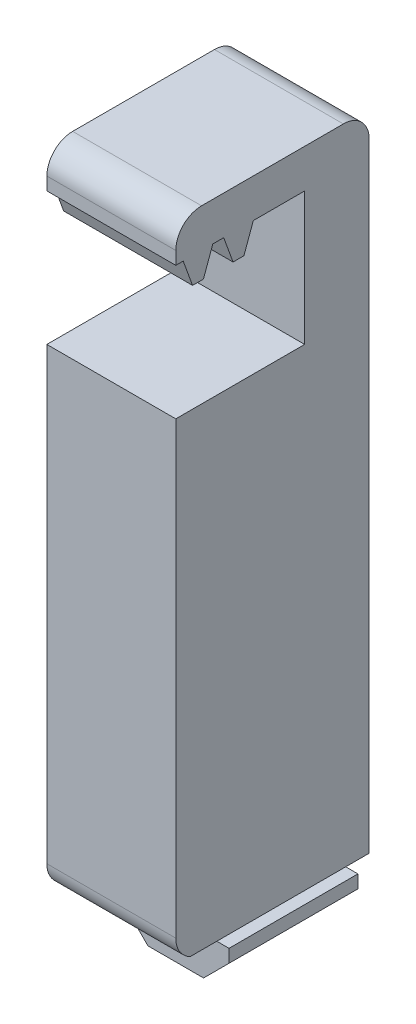
ISO-10303-21;
HEADER;
FILE_DESCRIPTION(('STEP AP214'),'2;1');
FILE_NAME('part.step','',(''),(''),'','','');
FILE_SCHEMA(('AUTOMOTIVE_DESIGN { 1 0 10303 214 1 1 1 1 }'));
ENDSEC;
DATA;
#1=APPLICATION_CONTEXT('core data for automotive mechanical design processes');
#2=APPLICATION_PROTOCOL_DEFINITION('international standard','automotive_design',2000,#1);
#3=PRODUCT_CONTEXT('',#1,'mechanical');
#4=PRODUCT('Part','Part','',(#3));
#5=PRODUCT_RELATED_PRODUCT_CATEGORY('part','',(#4));
#6=PRODUCT_DEFINITION_FORMATION('','',#4);
#7=PRODUCT_DEFINITION_CONTEXT('part definition',#1,'design');
#8=PRODUCT_DEFINITION('design','',#6,#7);
#9=PRODUCT_DEFINITION_SHAPE('','',#8);
#10=(LENGTH_UNIT() NAMED_UNIT(*) SI_UNIT(.MILLI.,.METRE.));
#11=(NAMED_UNIT(*) PLANE_ANGLE_UNIT() SI_UNIT($,.RADIAN.));
#12=(NAMED_UNIT(*) SI_UNIT($,.STERADIAN.) SOLID_ANGLE_UNIT());
#13=UNCERTAINTY_MEASURE_WITH_UNIT(LENGTH_MEASURE(1.E-05),#10,'distance_accuracy_value','');
#14=(GEOMETRIC_REPRESENTATION_CONTEXT(3) GLOBAL_UNCERTAINTY_ASSIGNED_CONTEXT((#13)) GLOBAL_UNIT_ASSIGNED_CONTEXT((#10,
#11,#12)) REPRESENTATION_CONTEXT('',''));
#15=CARTESIAN_POINT('',(0.,0.,0.));
#16=DIRECTION('',(0.,0.,1.));
#17=DIRECTION('',(1.,0.,0.));
#18=AXIS2_PLACEMENT_3D('',#15,#16,#17);
#19=CARTESIAN_POINT('',(6.35,63.7545080000001,0.));
#20=DIRECTION('',(0.,0.,-1.));
#21=DIRECTION('',(0.,1.,0.));
#22=AXIS2_PLACEMENT_3D('',#19,#20,#21);
#23=PLANE('',#22);
#24=DIRECTION('',(0.,-1.,0.));
#25=VECTOR('',#24,1.);
#26=CARTESIAN_POINT('',(6.35,63.7545080000001,0.));
#27=LINE('',#26,#25);
#28=CARTESIAN_POINT('',(6.35,61.2145080000001,0.));
#29=VERTEX_POINT('',#28);
#30=CARTESIAN_POINT('',(6.35,59.9445080000007,0.));
#31=VERTEX_POINT('',#30);
#32=EDGE_CURVE('E436',#29,#31,#27,.T.);
#33=ORIENTED_EDGE('',*,*,#32,.F.);
#34=DIRECTION('',(-1.,0.,0.));
#35=VECTOR('',#34,1.);
#36=CARTESIAN_POINT('',(6.35,61.2145080000001,0.));
#37=LINE('',#36,#35);
#38=CARTESIAN_POINT('',(-6.35,61.2145080000001,0.));
#39=VERTEX_POINT('',#38);
#40=EDGE_CURVE('E490',#29,#39,#37,.T.);
#41=ORIENTED_EDGE('',*,*,#40,.T.);
#42=DIRECTION('',(0.,-1.,0.));
#43=VECTOR('',#42,1.);
#44=CARTESIAN_POINT('',(-6.35,63.7545080000001,0.));
#45=LINE('',#44,#43);
#46=CARTESIAN_POINT('',(-6.35,59.9445080000007,0.));
#47=VERTEX_POINT('',#46);
#48=EDGE_CURVE('E435',#39,#47,#45,.T.);
#49=ORIENTED_EDGE('',*,*,#48,.T.);
#50=DIRECTION('',(1.,0.,0.));
#51=VECTOR('',#50,1.);
#52=CARTESIAN_POINT('',(-6.35,59.9445080000007,0.));
#53=LINE('',#52,#51);
#54=EDGE_CURVE('E414',#47,#31,#53,.T.);
#55=ORIENTED_EDGE('',*,*,#54,.T.);
#56=EDGE_LOOP('',(#33,#41,#49,#55));
#57=FACE_BOUND('',#56,.T.);
#58=ADVANCED_FACE('F35',(#57),#23,.F.);
#59=CARTESIAN_POINT('',(6.35,57.4045080000001,0.));
#60=DIRECTION('',(0.,1.,0.));
#61=DIRECTION('',(0.,0.,1.));
#62=AXIS2_PLACEMENT_3D('',#59,#60,#61);
#63=PLANE('',#62);
#64=DIRECTION('',(0.,0.,-1.));
#65=VECTOR('',#64,1.);
#66=CARTESIAN_POINT('',(6.35,57.4045080000001,0.));
#67=LINE('',#66,#65);
#68=CARTESIAN_POINT('',(6.35,57.4045080000001,-1.65498839503609));
#69=VERTEX_POINT('',#68);
#70=CARTESIAN_POINT('',(6.35,57.4045080000001,-2.72541999999958));
#71=VERTEX_POINT('',#70);
#72=EDGE_CURVE('E442',#69,#71,#67,.T.);
#73=ORIENTED_EDGE('',*,*,#72,.F.);
#74=DIRECTION('',(-1.,0.,0.));
#75=VECTOR('',#74,1.);
#76=CARTESIAN_POINT('',(6.35,57.4045080000001,-1.65498839503609));
#77=LINE('',#76,#75);
#78=CARTESIAN_POINT('',(-6.35,57.4045080000001,-1.65498839503609));
#79=VERTEX_POINT('',#78);
#80=EDGE_CURVE('E429',#69,#79,#77,.T.);
#81=ORIENTED_EDGE('',*,*,#80,.T.);
#82=DIRECTION('',(0.,0.,-1.));
#83=VECTOR('',#82,1.);
#84=CARTESIAN_POINT('',(-6.35,57.4045080000001,0.));
#85=LINE('',#84,#83);
#86=CARTESIAN_POINT('',(-6.35,57.4045080000001,-2.72541999999958));
#87=VERTEX_POINT('',#86);
#88=EDGE_CURVE('E260',#79,#87,#85,.T.);
#89=ORIENTED_EDGE('',*,*,#88,.T.);
#90=DIRECTION('',(1.,0.,0.));
#91=VECTOR('',#90,1.);
#92=CARTESIAN_POINT('',(6.35,57.4045080000001,-2.72541999999958));
#93=LINE('',#92,#91);
#94=EDGE_CURVE('E426',#87,#71,#93,.T.);
#95=ORIENTED_EDGE('',*,*,#94,.T.);
#96=EDGE_LOOP('',(#73,#81,#89,#95));
#97=FACE_BOUND('',#96,.T.);
#98=ADVANCED_FACE('F587',(#97),#63,.F.);
#99=CARTESIAN_POINT('',(6.35,0.,0.));
#100=DIRECTION('',(1.,0.,0.));
#101=DIRECTION('',(0.,0.,-1.));
#102=AXIS2_PLACEMENT_3D('',#99,#100,#101);
#103=PLANE('',#102);
#104=DIRECTION('',(0.,-1.,0.));
#105=VECTOR('',#104,1.);
#106=CARTESIAN_POINT('',(6.35,57.4045080000001,-12.7));
#107=LINE('',#106,#105);
#108=CARTESIAN_POINT('',(6.35,59.9445080000001,-12.7));
#109=VERTEX_POINT('',#108);
#110=CARTESIAN_POINT('',(6.35,46.8476330000001,-12.7));
#111=VERTEX_POINT('',#110);
#112=EDGE_CURVE('E443',#109,#111,#107,.T.);
#113=ORIENTED_EDGE('',*,*,#112,.T.);
#114=DIRECTION('',(0.,0.,-1.));
#115=VECTOR('',#114,1.);
#116=CARTESIAN_POINT('',(6.35,46.8476330000001,0.));
#117=LINE('',#116,#115);
#118=CARTESIAN_POINT('',(6.35,46.8476330000001,0.));
#119=VERTEX_POINT('',#118);
#120=EDGE_CURVE('E264',#119,#111,#117,.T.);
#121=ORIENTED_EDGE('',*,*,#120,.F.);
#122=DIRECTION('',(0.,-1.,0.));
#123=VECTOR('',#122,1.);
#124=CARTESIAN_POINT('',(6.35,47.2445080000001,0.));
#125=LINE('',#124,#123);
#126=CARTESIAN_POINT('',(6.35,2.54,0.));
#127=VERTEX_POINT('',#126);
#128=EDGE_CURVE('E445',#119,#127,#125,.T.);
#129=ORIENTED_EDGE('',*,*,#128,.T.);
#130=CARTESIAN_POINT('',(6.35,2.54,-2.54));
#131=DIRECTION('',(1.,0.,0.));
#132=DIRECTION('',(0.,0.,-1.));
#133=AXIS2_PLACEMENT_3D('',#130,#131,#132);
#134=CIRCLE('',#133,2.54);
#135=CARTESIAN_POINT('',(6.35,0.253999999999999,-1.43283966834067));
#136=VERTEX_POINT('',#135);
#137=EDGE_CURVE('E487',#127,#136,#134,.T.);
#138=ORIENTED_EDGE('',*,*,#137,.T.);
#139=DIRECTION('',(0.,0.,-1.));
#140=VECTOR('',#139,1.);
#141=CARTESIAN_POINT('',(6.35,0.253999999999999,0.));
#142=LINE('',#141,#140);
#143=CARTESIAN_POINT('',(6.35,0.254000000000001,-19.05));
#144=VERTEX_POINT('',#143);
#145=EDGE_CURVE('E312',#136,#144,#142,.T.);
#146=ORIENTED_EDGE('',*,*,#145,.T.);
#147=DIRECTION('',(0.,1.,0.));
#148=VECTOR('',#147,1.);
#149=CARTESIAN_POINT('',(6.35,63.7545080000001,-19.05));
#150=LINE('',#149,#148);
#151=CARTESIAN_POINT('',(6.35,61.2145080000001,-19.05));
#152=VERTEX_POINT('',#151);
#153=EDGE_CURVE('E447',#144,#152,#150,.T.);
#154=ORIENTED_EDGE('',*,*,#153,.T.);
#155=CARTESIAN_POINT('',(6.35,61.2145080000001,-16.51));
#156=DIRECTION('',(1.,0.,0.));
#157=DIRECTION('',(0.,0.,-1.));
#158=AXIS2_PLACEMENT_3D('',#155,#156,#157);
#159=CIRCLE('',#158,2.54);
#160=CARTESIAN_POINT('',(6.35,63.7545080000001,-16.51));
#161=VERTEX_POINT('',#160);
#162=EDGE_CURVE('E483',#152,#161,#159,.T.);
#163=ORIENTED_EDGE('',*,*,#162,.T.);
#164=DIRECTION('',(0.,0.,1.));
#165=VECTOR('',#164,1.);
#166=CARTESIAN_POINT('',(6.35,63.7545080000001,-12.7));
#167=LINE('',#166,#165);
#168=CARTESIAN_POINT('',(6.35,63.7545080000001,-2.54));
#169=VERTEX_POINT('',#168);
#170=EDGE_CURVE('E449',#161,#169,#167,.T.);
#171=ORIENTED_EDGE('',*,*,#170,.T.);
#172=CARTESIAN_POINT('',(6.35,61.2145080000001,-2.54));
#173=DIRECTION('',(1.,0.,0.));
#174=DIRECTION('',(0.,0.,-1.));
#175=AXIS2_PLACEMENT_3D('',#172,#173,#174);
#176=CIRCLE('',#175,2.54);
#177=EDGE_CURVE('E485',#169,#29,#176,.T.);
#178=ORIENTED_EDGE('',*,*,#177,.T.);
#179=ORIENTED_EDGE('',*,*,#32,.T.);
#180=DIRECTION('',(0.,0.,-1.));
#181=VECTOR('',#180,1.);
#182=CARTESIAN_POINT('',(6.35,59.9445080000007,0.));
#183=LINE('',#182,#181);
#184=CARTESIAN_POINT('',(6.35,59.9445080000007,-0.730503999999521));
#185=VERTEX_POINT('',#184);
#186=EDGE_CURVE('E403',#31,#185,#183,.T.);
#187=ORIENTED_EDGE('',*,*,#186,.T.);
#188=DIRECTION('',(0.,0.939692620785888,0.342020143325726));
#189=VECTOR('',#188,1.);
#190=CARTESIAN_POINT('',(6.35,7.24695483556498,-19.9108447705185));
#191=LINE('',#190,#189);
#192=EDGE_CURVE('E401',#69,#185,#191,.T.);
#193=ORIENTED_EDGE('',*,*,#192,.F.);
#194=ORIENTED_EDGE('',*,*,#72,.T.);
#195=DIRECTION('',(0.,-0.939692620785888,0.342020143325726));
#196=VECTOR('',#195,1.);
#197=CARTESIAN_POINT('',(6.35,5.83911871471688,16.0428468181965));
#198=LINE('',#197,#196);
#199=CARTESIAN_POINT('',(6.35,59.9445080000007,-3.6499043950361));
#200=VERTEX_POINT('',#199);
#201=EDGE_CURVE('E399',#200,#71,#198,.T.);
#202=ORIENTED_EDGE('',*,*,#201,.F.);
#203=DIRECTION('',(0.,0.,-1.));
#204=VECTOR('',#203,1.);
#205=CARTESIAN_POINT('',(6.35,59.9445080000007,0.));
#206=LINE('',#205,#204);
#207=CARTESIAN_POINT('',(6.35,59.9445080000007,-4.72033599999955));
#208=VERTEX_POINT('',#207);
#209=EDGE_CURVE('E396',#200,#208,#206,.T.);
#210=ORIENTED_EDGE('',*,*,#209,.T.);
#211=DIRECTION('',(0.,0.939692620785888,0.342020143325726));
#212=VECTOR('',#211,1.);
#213=CARTESIAN_POINT('',(6.35,8.5292621227306,-23.4339550868075));
#214=LINE('',#213,#212);
#215=CARTESIAN_POINT('',(6.35,57.4045080000001,-5.64482039503605));
#216=VERTEX_POINT('',#215);
#217=EDGE_CURVE('E378',#216,#208,#214,.T.);
#218=ORIENTED_EDGE('',*,*,#217,.F.);
#219=CARTESIAN_POINT('',(6.35,57.4045080000001,-6.71525199999965));
#220=VERTEX_POINT('',#219);
#221=EDGE_CURVE('E438',#216,#220,#67,.T.);
#222=ORIENTED_EDGE('',*,*,#221,.T.);
#223=DIRECTION('',(0.,-0.939692620785888,0.342020143325726));
#224=VECTOR('',#223,1.);
#225=CARTESIAN_POINT('',(6.35,4.55681142755125,12.5197365019074));
#226=LINE('',#225,#224);
#227=CARTESIAN_POINT('',(6.35,59.9445080000007,-7.63973639503612));
#228=VERTEX_POINT('',#227);
#229=EDGE_CURVE('E383',#228,#220,#226,.T.);
#230=ORIENTED_EDGE('',*,*,#229,.F.);
#231=DIRECTION('',(0.,-1.35653261717461E-13,-1.));
#232=VECTOR('',#231,1.);
#233=CARTESIAN_POINT('',(6.35,59.9445080000018,-8.10462807976364E-12));
#234=LINE('',#233,#232);
#235=EDGE_CURVE('E406',#228,#109,#234,.T.);
#236=ORIENTED_EDGE('',*,*,#235,.T.);
#237=EDGE_LOOP('',(#113,#121,#129,#138,#146,#154,#163,#171,#178,#179,#187,#193,#194,#202,#210,
#218,#222,#230,#236));
#238=FACE_BOUND('',#237,.T.);
#239=ADVANCED_FACE('F537',(#238),#103,.T.);
#240=CARTESIAN_POINT('',(-6.35,0.,0.));
#241=DIRECTION('',(1.,0.,0.));
#242=DIRECTION('',(0.,0.,-1.));
#243=AXIS2_PLACEMENT_3D('',#240,#241,#242);
#244=PLANE('',#243);
#245=DIRECTION('',(0.,0.,-1.));
#246=VECTOR('',#245,1.);
#247=CARTESIAN_POINT('',(-6.35,46.8476330000001,0.));
#248=LINE('',#247,#246);
#249=CARTESIAN_POINT('',(-6.35,46.8476330000001,0.));
#250=VERTEX_POINT('',#249);
#251=CARTESIAN_POINT('',(-6.35,46.8476330000001,-12.7));
#252=VERTEX_POINT('',#251);
#253=EDGE_CURVE('E50',#250,#252,#248,.T.);
#254=ORIENTED_EDGE('',*,*,#253,.T.);
#255=DIRECTION('',(0.,-1.,0.));
#256=VECTOR('',#255,1.);
#257=CARTESIAN_POINT('',(-6.35,57.4045080000001,-12.7));
#258=LINE('',#257,#256);
#259=CARTESIAN_POINT('',(-6.35,59.9445080000001,-12.7));
#260=VERTEX_POINT('',#259);
#261=EDGE_CURVE('E250',#260,#252,#258,.T.);
#262=ORIENTED_EDGE('',*,*,#261,.F.);
#263=DIRECTION('',(0.,-1.35653261717461E-13,-1.));
#264=VECTOR('',#263,1.);
#265=CARTESIAN_POINT('',(-6.35,59.9445080000018,-8.10462807976364E-12));
#266=LINE('',#265,#264);
#267=CARTESIAN_POINT('',(-6.35,59.9445080000007,-7.63973639503612));
#268=VERTEX_POINT('',#267);
#269=EDGE_CURVE('E389',#268,#260,#266,.T.);
#270=ORIENTED_EDGE('',*,*,#269,.F.);
#271=DIRECTION('',(0.,-0.939692620785888,0.342020143325726));
#272=VECTOR('',#271,1.);
#273=CARTESIAN_POINT('',(-6.35,4.55681142755125,12.5197365019074));
#274=LINE('',#273,#272);
#275=CARTESIAN_POINT('',(-6.35,57.4045080000001,-6.71525199999965));
#276=VERTEX_POINT('',#275);
#277=EDGE_CURVE('E391',#268,#276,#274,.T.);
#278=ORIENTED_EDGE('',*,*,#277,.T.);
#279=CARTESIAN_POINT('',(-6.35,57.4045080000001,-5.64482039503605));
#280=VERTEX_POINT('',#279);
#281=EDGE_CURVE('E454',#280,#276,#85,.T.);
#282=ORIENTED_EDGE('',*,*,#281,.F.);
#283=DIRECTION('',(0.,0.939692620785888,0.342020143325726));
#284=VECTOR('',#283,1.);
#285=CARTESIAN_POINT('',(-6.35,8.5292621227306,-23.4339550868075));
#286=LINE('',#285,#284);
#287=CARTESIAN_POINT('',(-6.35,59.9445080000007,-4.72033599999953));
#288=VERTEX_POINT('',#287);
#289=EDGE_CURVE('E464',#280,#288,#286,.T.);
#290=ORIENTED_EDGE('',*,*,#289,.T.);
#291=DIRECTION('',(0.,0.,-1.));
#292=VECTOR('',#291,1.);
#293=CARTESIAN_POINT('',(-6.35,59.9445080000007,0.));
#294=LINE('',#293,#292);
#295=CARTESIAN_POINT('',(-6.35,59.9445080000007,-3.6499043950361));
#296=VERTEX_POINT('',#295);
#297=EDGE_CURVE('E379',#296,#288,#294,.T.);
#298=ORIENTED_EDGE('',*,*,#297,.F.);
#299=DIRECTION('',(0.,-0.939692620785888,0.342020143325726));
#300=VECTOR('',#299,1.);
#301=CARTESIAN_POINT('',(-6.35,5.83911871471688,16.0428468181965));
#302=LINE('',#301,#300);
#303=EDGE_CURVE('E382',#296,#87,#302,.T.);
#304=ORIENTED_EDGE('',*,*,#303,.T.);
#305=ORIENTED_EDGE('',*,*,#88,.F.);
#306=DIRECTION('',(0.,0.939692620785888,0.342020143325726));
#307=VECTOR('',#306,1.);
#308=CARTESIAN_POINT('',(-6.35,7.24695483556499,-19.9108447705185));
#309=LINE('',#308,#307);
#310=CARTESIAN_POINT('',(-6.35,59.9445080000007,-0.730503999999566));
#311=VERTEX_POINT('',#310);
#312=EDGE_CURVE('E467',#79,#311,#309,.T.);
#313=ORIENTED_EDGE('',*,*,#312,.T.);
#314=DIRECTION('',(0.,0.,-1.));
#315=VECTOR('',#314,1.);
#316=CARTESIAN_POINT('',(-6.35,59.9445080000007,0.));
#317=LINE('',#316,#315);
#318=EDGE_CURVE('E386',#47,#311,#317,.T.);
#319=ORIENTED_EDGE('',*,*,#318,.F.);
#320=ORIENTED_EDGE('',*,*,#48,.F.);
#321=CARTESIAN_POINT('',(-6.35,61.2145080000001,-2.54));
#322=DIRECTION('',(1.,0.,0.));
#323=DIRECTION('',(0.,0.,-1.));
#324=AXIS2_PLACEMENT_3D('',#321,#322,#323);
#325=CIRCLE('',#324,2.54);
#326=CARTESIAN_POINT('',(-6.35,63.7545080000001,-2.54));
#327=VERTEX_POINT('',#326);
#328=EDGE_CURVE('E476',#39,#327,#325,.F.);
#329=ORIENTED_EDGE('',*,*,#328,.T.);
#330=DIRECTION('',(0.,0.,1.));
#331=VECTOR('',#330,1.);
#332=CARTESIAN_POINT('',(-6.35,63.7545080000001,0.));
#333=LINE('',#332,#331);
#334=CARTESIAN_POINT('',(-6.35,63.7545080000001,-16.51));
#335=VERTEX_POINT('',#334);
#336=EDGE_CURVE('E439',#335,#327,#333,.T.);
#337=ORIENTED_EDGE('',*,*,#336,.F.);
#338=CARTESIAN_POINT('',(-6.35,61.2145080000001,-16.51));
#339=DIRECTION('',(1.,0.,0.));
#340=DIRECTION('',(0.,0.,-1.));
#341=AXIS2_PLACEMENT_3D('',#338,#339,#340);
#342=CIRCLE('',#341,2.54);
#343=CARTESIAN_POINT('',(-6.35,61.2145080000001,-19.05));
#344=VERTEX_POINT('',#343);
#345=EDGE_CURVE('E473',#335,#344,#342,.F.);
#346=ORIENTED_EDGE('',*,*,#345,.T.);
#347=DIRECTION('',(0.,1.,0.));
#348=VECTOR('',#347,1.);
#349=CARTESIAN_POINT('',(-6.35,63.7545080000001,-19.05));
#350=LINE('',#349,#348);
#351=CARTESIAN_POINT('',(-6.35,0.254000000000001,-19.05));
#352=VERTEX_POINT('',#351);
#353=EDGE_CURVE('E458',#352,#344,#350,.T.);
#354=ORIENTED_EDGE('',*,*,#353,.F.);
#355=DIRECTION('',(0.,0.,-1.));
#356=VECTOR('',#355,1.);
#357=CARTESIAN_POINT('',(-6.35,0.253999999999999,0.));
#358=LINE('',#357,#356);
#359=CARTESIAN_POINT('',(-6.35,0.253999999999999,-1.43283966834067));
#360=VERTEX_POINT('',#359);
#361=EDGE_CURVE('E311',#360,#352,#358,.T.);
#362=ORIENTED_EDGE('',*,*,#361,.F.);
#363=CARTESIAN_POINT('',(-6.35,2.54,-2.54));
#364=DIRECTION('',(1.,0.,0.));
#365=DIRECTION('',(0.,0.,-1.));
#366=AXIS2_PLACEMENT_3D('',#363,#364,#365);
#367=CIRCLE('',#366,2.54);
#368=CARTESIAN_POINT('',(-6.35,2.54,0.));
#369=VERTEX_POINT('',#368);
#370=EDGE_CURVE('E478',#360,#369,#367,.F.);
#371=ORIENTED_EDGE('',*,*,#370,.T.);
#372=DIRECTION('',(0.,-1.,0.));
#373=VECTOR('',#372,1.);
#374=CARTESIAN_POINT('',(-6.35,47.2445080000001,0.));
#375=LINE('',#374,#373);
#376=EDGE_CURVE('E259',#250,#369,#375,.T.);
#377=ORIENTED_EDGE('',*,*,#376,.F.);
#378=EDGE_LOOP('',(#254,#262,#270,#278,#282,#290,#298,#304,#305,#313,#319,#320,#329,#337,#346,
#354,#362,#371,#377));
#379=FACE_BOUND('',#378,.T.);
#380=ADVANCED_FACE('F269',(#379),#244,.F.);
#381=ORIENTED_EDGE('',*,*,#281,.T.);
#382=DIRECTION('',(1.,0.,0.));
#383=VECTOR('',#382,1.);
#384=CARTESIAN_POINT('',(6.35,57.4045080000001,-6.71525199999965));
#385=LINE('',#384,#383);
#386=EDGE_CURVE('E432',#276,#220,#385,.T.);
#387=ORIENTED_EDGE('',*,*,#386,.T.);
#388=ORIENTED_EDGE('',*,*,#221,.F.);
#389=DIRECTION('',(-1.,0.,0.));
#390=VECTOR('',#389,1.);
#391=CARTESIAN_POINT('',(6.35,57.4045080000001,-5.64482039503605));
#392=LINE('',#391,#390);
#393=EDGE_CURVE('E412',#216,#280,#392,.T.);
#394=ORIENTED_EDGE('',*,*,#393,.T.);
#395=EDGE_LOOP('',(#381,#387,#388,#394));
#396=FACE_BOUND('',#395,.T.);
#397=ADVANCED_FACE('F595',(#396),#63,.F.);
#398=CARTESIAN_POINT('',(6.35,57.4045080000001,-12.7));
#399=DIRECTION('',(0.,0.,-1.));
#400=DIRECTION('',(0.,1.,0.));
#401=AXIS2_PLACEMENT_3D('',#398,#399,#400);
#402=PLANE('',#401);
#403=ORIENTED_EDGE('',*,*,#261,.T.);
#404=DIRECTION('',(1.,0.,0.));
#405=VECTOR('',#404,1.);
#406=CARTESIAN_POINT('',(-6.35,46.8476330000001,-12.7));
#407=LINE('',#406,#405);
#408=EDGE_CURVE('E252',#252,#111,#407,.T.);
#409=ORIENTED_EDGE('',*,*,#408,.T.);
#410=ORIENTED_EDGE('',*,*,#112,.F.);
#411=DIRECTION('',(1.,0.,0.));
#412=VECTOR('',#411,1.);
#413=CARTESIAN_POINT('',(-6.35,59.9445080000001,-12.7));
#414=LINE('',#413,#412);
#415=EDGE_CURVE('E255',#260,#109,#414,.T.);
#416=ORIENTED_EDGE('',*,*,#415,.F.);
#417=EDGE_LOOP('',(#403,#409,#410,#416));
#418=FACE_BOUND('',#417,.T.);
#419=ADVANCED_FACE('F251',(#418),#402,.F.);
#420=CARTESIAN_POINT('',(6.35,47.2445080000001,0.));
#421=DIRECTION('',(0.,0.,-1.));
#422=DIRECTION('',(0.,1.,0.));
#423=AXIS2_PLACEMENT_3D('',#420,#421,#422);
#424=PLANE('',#423);
#425=ORIENTED_EDGE('',*,*,#128,.F.);
#426=DIRECTION('',(1.,0.,0.));
#427=VECTOR('',#426,1.);
#428=CARTESIAN_POINT('',(-6.35,46.8476330000001,0.));
#429=LINE('',#428,#427);
#430=EDGE_CURVE('E266',#250,#119,#429,.T.);
#431=ORIENTED_EDGE('',*,*,#430,.F.);
#432=ORIENTED_EDGE('',*,*,#376,.T.);
#433=DIRECTION('',(-1.,0.,0.));
#434=VECTOR('',#433,1.);
#435=CARTESIAN_POINT('',(6.35,2.54,0.));
#436=LINE('',#435,#434);
#437=EDGE_CURVE('E480',#369,#127,#436,.F.);
#438=ORIENTED_EDGE('',*,*,#437,.T.);
#439=EDGE_LOOP('',(#425,#431,#432,#438));
#440=FACE_BOUND('',#439,.T.);
#441=ADVANCED_FACE('F542',(#440),#424,.F.);
#442=CARTESIAN_POINT('',(6.35,0.,-6.35));
#443=DIRECTION('',(0.,1.,0.));
#444=DIRECTION('',(0.,0.,1.));
#445=AXIS2_PLACEMENT_3D('',#442,#443,#444);
#446=PLANE('',#445);
#447=DIRECTION('',(-1.,0.,0.));
#448=VECTOR('',#447,1.);
#449=CARTESIAN_POINT('',(6.35,0.,-6.35));
#450=LINE('',#449,#448);
#451=CARTESIAN_POINT('',(4.22078975516408,0.,-6.35));
#452=VERTEX_POINT('',#451);
#453=CARTESIAN_POINT('',(-4.22078975515034,0.,-6.35));
#454=VERTEX_POINT('',#453);
#455=EDGE_CURVE('E452',#452,#454,#450,.T.);
#456=ORIENTED_EDGE('',*,*,#455,.F.);
#457=DIRECTION('',(0.,0.,1.));
#458=VECTOR('',#457,1.);
#459=CARTESIAN_POINT('',(4.22078975516408,0.,-6.35));
#460=LINE('',#459,#458);
#461=CARTESIAN_POINT('',(4.22078975516408,0.,-2.54));
#462=VERTEX_POINT('',#461);
#463=EDGE_CURVE('E345',#452,#462,#460,.T.);
#464=ORIENTED_EDGE('',*,*,#463,.T.);
#465=DIRECTION('',(-1.,0.,0.));
#466=VECTOR('',#465,1.);
#467=CARTESIAN_POINT('',(6.35,0.,-2.54));
#468=LINE('',#467,#466);
#469=CARTESIAN_POINT('',(-4.22078975515034,0.,-2.54));
#470=VERTEX_POINT('',#469);
#471=EDGE_CURVE('E470',#462,#470,#468,.T.);
#472=ORIENTED_EDGE('',*,*,#471,.T.);
#473=DIRECTION('',(0.,0.,-1.));
#474=VECTOR('',#473,1.);
#475=CARTESIAN_POINT('',(-4.22078975515034,0.,-6.35000000000001));
#476=LINE('',#475,#474);
#477=EDGE_CURVE('E315',#470,#454,#476,.T.);
#478=ORIENTED_EDGE('',*,*,#477,.T.);
#479=EDGE_LOOP('',(#456,#464,#472,#478));
#480=FACE_BOUND('',#479,.T.);
#481=ADVANCED_FACE('F513',(#480),#446,.F.);
#482=CARTESIAN_POINT('',(6.35,0.,-6.35));
#483=DIRECTION('',(0.,0.,-1.));
#484=DIRECTION('',(-1.,0.,0.));
#485=AXIS2_PLACEMENT_3D('',#482,#483,#484);
#486=PLANE('',#485);
#487=DIRECTION('',(0.,1.,0.));
#488=VECTOR('',#487,1.);
#489=CARTESIAN_POINT('',(2.87100000000685,0.,-6.35));
#490=LINE('',#489,#488);
#491=CARTESIAN_POINT('',(2.87100000000685,-2.05399999999996,-6.35));
#492=VERTEX_POINT('',#491);
#493=CARTESIAN_POINT('',(2.87100000000685,-1.34978975515722,-6.35));
#494=VERTEX_POINT('',#493);
#495=EDGE_CURVE('E375',#492,#494,#490,.T.);
#496=ORIENTED_EDGE('',*,*,#495,.T.);
#497=DIRECTION('',(0.70710678118655,0.707106781186545,0.));
#498=VECTOR('',#497,1.);
#499=CARTESIAN_POINT('',(5.28539487758205,1.06460512241796,-6.35));
#500=LINE('',#499,#498);
#501=EDGE_CURVE('E348',#494,#452,#500,.T.);
#502=ORIENTED_EDGE('',*,*,#501,.T.);
#503=ORIENTED_EDGE('',*,*,#455,.T.);
#504=DIRECTION('',(0.707106781186545,-0.70710678118655,0.));
#505=VECTOR('',#504,1.);
#506=CARTESIAN_POINT('',(1.06460512242479,-5.28539487757517,-6.35));
#507=LINE('',#506,#505);
#508=CARTESIAN_POINT('',(-2.87099999999315,-1.3497897551572,-6.35));
#509=VERTEX_POINT('',#508);
#510=EDGE_CURVE('E342',#454,#509,#507,.T.);
#511=ORIENTED_EDGE('',*,*,#510,.T.);
#512=DIRECTION('',(0.,-1.,0.));
#513=VECTOR('',#512,1.);
#514=CARTESIAN_POINT('',(-2.87099999999315,0.,-6.35));
#515=LINE('',#514,#513);
#516=CARTESIAN_POINT('',(-2.87099999999315,-2.05399999999996,-6.35));
#517=VERTEX_POINT('',#516);
#518=EDGE_CURVE('E351',#509,#517,#515,.T.);
#519=ORIENTED_EDGE('',*,*,#518,.T.);
#520=DIRECTION('',(-1.,0.,0.));
#521=VECTOR('',#520,1.);
#522=CARTESIAN_POINT('',(6.35,-2.05399999999996,-6.35));
#523=LINE('',#522,#521);
#524=CARTESIAN_POINT('',(-5.24599999999315,-2.05399999999996,-6.35));
#525=VERTEX_POINT('',#524);
#526=EDGE_CURVE('E354',#517,#525,#523,.T.);
#527=ORIENTED_EDGE('',*,*,#526,.T.);
#528=DIRECTION('',(0.,-1.,0.));
#529=VECTOR('',#528,1.);
#530=CARTESIAN_POINT('',(-5.24599999999315,0.,-6.35));
#531=LINE('',#530,#529);
#532=CARTESIAN_POINT('',(-5.24599999999315,-3.33412958337746,-6.35));
#533=VERTEX_POINT('',#532);
#534=EDGE_CURVE('E357',#525,#533,#531,.T.);
#535=ORIENTED_EDGE('',*,*,#534,.T.);
#536=DIRECTION('',(0.70710678118655,-0.707106781186545,0.));
#537=VECTOR('',#536,1.);
#538=CARTESIAN_POINT('',(-1.11506479168526,-7.46506479168532,-6.35));
#539=LINE('',#538,#537);
#540=CARTESIAN_POINT('',(-2.7381295833706,-5.84199999999999,-6.35));
#541=VERTEX_POINT('',#540);
#542=EDGE_CURVE('E360',#533,#541,#539,.T.);
#543=ORIENTED_EDGE('',*,*,#542,.T.);
#544=DIRECTION('',(1.,0.,0.));
#545=VECTOR('',#544,1.);
#546=CARTESIAN_POINT('',(6.35,-5.84199999999999,-6.35));
#547=LINE('',#546,#545);
#548=CARTESIAN_POINT('',(2.73812958338426,-5.84199999999999,-6.35));
#549=VERTEX_POINT('',#548);
#550=EDGE_CURVE('E363',#541,#549,#547,.T.);
#551=ORIENTED_EDGE('',*,*,#550,.T.);
#552=DIRECTION('',(0.707106781186554,0.707106781186541,0.));
#553=VECTOR('',#552,1.);
#554=CARTESIAN_POINT('',(7.46506479169216,-1.11506479169218,-6.35));
#555=LINE('',#554,#553);
#556=CARTESIAN_POINT('',(5.24600000000684,-3.33412958337746,-6.35));
#557=VERTEX_POINT('',#556);
#558=EDGE_CURVE('E366',#549,#557,#555,.T.);
#559=ORIENTED_EDGE('',*,*,#558,.T.);
#560=DIRECTION('',(0.,1.,0.));
#561=VECTOR('',#560,1.);
#562=CARTESIAN_POINT('',(5.24600000000684,0.,-6.35));
#563=LINE('',#562,#561);
#564=CARTESIAN_POINT('',(5.24600000000684,-2.05399999999996,-6.35));
#565=VERTEX_POINT('',#564);
#566=EDGE_CURVE('E369',#557,#565,#563,.T.);
#567=ORIENTED_EDGE('',*,*,#566,.T.);
#568=DIRECTION('',(-1.,0.,0.));
#569=VECTOR('',#568,1.);
#570=CARTESIAN_POINT('',(6.35,-2.05399999999996,-6.35));
#571=LINE('',#570,#569);
#572=EDGE_CURVE('E372',#565,#492,#571,.T.);
#573=ORIENTED_EDGE('',*,*,#572,.T.);
#574=EDGE_LOOP('',(#496,#502,#503,#511,#519,#527,#535,#543,#551,#559,#567,#573));
#575=FACE_BOUND('',#574,.T.);
#576=ADVANCED_FACE('F522',(#575),#486,.F.);
#577=CARTESIAN_POINT('',(6.35,63.7545080000001,-19.05));
#578=DIRECTION('',(0.,0.,1.));
#579=DIRECTION('',(0.,-1.,0.));
#580=AXIS2_PLACEMENT_3D('',#577,#578,#579);
#581=PLANE('',#580);
#582=ORIENTED_EDGE('',*,*,#153,.F.);
#583=DIRECTION('',(1.,0.,0.));
#584=VECTOR('',#583,1.);
#585=CARTESIAN_POINT('',(4.47478975516408,0.254000000000001,-19.05));
#586=LINE('',#585,#584);
#587=CARTESIAN_POINT('',(4.47478975516408,0.254000000000001,-19.05));
#588=VERTEX_POINT('',#587);
#589=EDGE_CURVE('E309',#588,#144,#586,.T.);
#590=ORIENTED_EDGE('',*,*,#589,.F.);
#591=DIRECTION('',(0.70710678118655,0.707106781186545,0.));
#592=VECTOR('',#591,1.);
#593=CARTESIAN_POINT('',(2.87100000000685,-1.34978975515722,-19.05));
#594=LINE('',#593,#592);
#595=CARTESIAN_POINT('',(2.87100000000685,-1.34978975515722,-19.05));
#596=VERTEX_POINT('',#595);
#597=EDGE_CURVE('E306',#596,#588,#594,.T.);
#598=ORIENTED_EDGE('',*,*,#597,.F.);
#599=DIRECTION('',(0.,1.,0.));
#600=VECTOR('',#599,1.);
#601=CARTESIAN_POINT('',(2.87100000000685,-2.05399999999996,-19.05));
#602=LINE('',#601,#600);
#603=CARTESIAN_POINT('',(2.87100000000685,-2.05399999999996,-19.05));
#604=VERTEX_POINT('',#603);
#605=EDGE_CURVE('E303',#604,#596,#602,.T.);
#606=ORIENTED_EDGE('',*,*,#605,.F.);
#607=DIRECTION('',(-1.,0.,0.));
#608=VECTOR('',#607,1.);
#609=CARTESIAN_POINT('',(5.24600000000684,-2.05399999999996,-19.05));
#610=LINE('',#609,#608);
#611=CARTESIAN_POINT('',(5.24600000000684,-2.05399999999996,-19.05));
#612=VERTEX_POINT('',#611);
#613=EDGE_CURVE('E300',#612,#604,#610,.T.);
#614=ORIENTED_EDGE('',*,*,#613,.F.);
#615=DIRECTION('',(0.,1.,0.));
#616=VECTOR('',#615,1.);
#617=CARTESIAN_POINT('',(5.24600000000684,-3.33412958337746,-19.05));
#618=LINE('',#617,#616);
#619=CARTESIAN_POINT('',(5.24600000000684,-3.33412958337746,-19.05));
#620=VERTEX_POINT('',#619);
#621=EDGE_CURVE('E297',#620,#612,#618,.T.);
#622=ORIENTED_EDGE('',*,*,#621,.F.);
#623=DIRECTION('',(0.707106781186554,0.707106781186541,0.));
#624=VECTOR('',#623,1.);
#625=CARTESIAN_POINT('',(2.73812958338426,-5.84199999999999,-19.05));
#626=LINE('',#625,#624);
#627=CARTESIAN_POINT('',(2.73812958338426,-5.84199999999999,-19.05));
#628=VERTEX_POINT('',#627);
#629=EDGE_CURVE('E294',#628,#620,#626,.T.);
#630=ORIENTED_EDGE('',*,*,#629,.F.);
#631=DIRECTION('',(1.,0.,0.));
#632=VECTOR('',#631,1.);
#633=CARTESIAN_POINT('',(2.73812958338426,-5.84199999999999,-19.05));
#634=LINE('',#633,#632);
#635=CARTESIAN_POINT('',(-2.7381295833706,-5.84199999999999,-19.05));
#636=VERTEX_POINT('',#635);
#637=EDGE_CURVE('E291',#636,#628,#634,.T.);
#638=ORIENTED_EDGE('',*,*,#637,.F.);
#639=DIRECTION('',(0.70710678118655,-0.707106781186545,0.));
#640=VECTOR('',#639,1.);
#641=CARTESIAN_POINT('',(-5.24599999999315,-3.33412958337746,-19.05));
#642=LINE('',#641,#640);
#643=CARTESIAN_POINT('',(-5.24599999999315,-3.33412958337746,-19.05));
#644=VERTEX_POINT('',#643);
#645=EDGE_CURVE('E288',#644,#636,#642,.T.);
#646=ORIENTED_EDGE('',*,*,#645,.F.);
#647=DIRECTION('',(0.,-1.,0.));
#648=VECTOR('',#647,1.);
#649=CARTESIAN_POINT('',(-5.24599999999315,-2.05399999999996,-19.05));
#650=LINE('',#649,#648);
#651=CARTESIAN_POINT('',(-5.24599999999315,-2.05399999999996,-19.05));
#652=VERTEX_POINT('',#651);
#653=EDGE_CURVE('E285',#652,#644,#650,.T.);
#654=ORIENTED_EDGE('',*,*,#653,.F.);
#655=DIRECTION('',(-1.,0.,0.));
#656=VECTOR('',#655,1.);
#657=CARTESIAN_POINT('',(-2.87099999999315,-2.05399999999996,-19.05));
#658=LINE('',#657,#656);
#659=CARTESIAN_POINT('',(-2.87099999999315,-2.05399999999996,-19.05));
#660=VERTEX_POINT('',#659);
#661=EDGE_CURVE('E282',#660,#652,#658,.T.);
#662=ORIENTED_EDGE('',*,*,#661,.F.);
#663=DIRECTION('',(0.,-1.,0.));
#664=VECTOR('',#663,1.);
#665=CARTESIAN_POINT('',(-2.87099999999315,-1.34978975515719,-19.05));
#666=LINE('',#665,#664);
#667=CARTESIAN_POINT('',(-2.87099999999315,-1.34978975515719,-19.05));
#668=VERTEX_POINT('',#667);
#669=EDGE_CURVE('E279',#668,#660,#666,.T.);
#670=ORIENTED_EDGE('',*,*,#669,.F.);
#671=DIRECTION('',(0.707106781186545,-0.70710678118655,0.));
#672=VECTOR('',#671,1.);
#673=CARTESIAN_POINT('',(-4.47478975515034,0.254000000000001,-19.05));
#674=LINE('',#673,#672);
#675=CARTESIAN_POINT('',(-4.47478975515034,0.254000000000001,-19.05));
#676=VERTEX_POINT('',#675);
#677=EDGE_CURVE('E276',#676,#668,#674,.T.);
#678=ORIENTED_EDGE('',*,*,#677,.F.);
#679=DIRECTION('',(1.,0.,0.));
#680=VECTOR('',#679,1.);
#681=CARTESIAN_POINT('',(-6.35,0.254000000000001,-19.05));
#682=LINE('',#681,#680);
#683=EDGE_CURVE('E265',#352,#676,#682,.T.);
#684=ORIENTED_EDGE('',*,*,#683,.F.);
#685=ORIENTED_EDGE('',*,*,#353,.T.);
#686=DIRECTION('',(-1.,0.,0.));
#687=VECTOR('',#686,1.);
#688=CARTESIAN_POINT('',(6.35,61.2145080000001,-19.05));
#689=LINE('',#688,#687);
#690=EDGE_CURVE('E498',#344,#152,#689,.F.);
#691=ORIENTED_EDGE('',*,*,#690,.T.);
#692=EDGE_LOOP('',(#582,#590,#598,#606,#614,#622,#630,#638,#646,#654,#662,#670,#678,#684,#685,#691));
#693=FACE_BOUND('',#692,.T.);
#694=ADVANCED_FACE('F533',(#693),#581,.F.);
#695=CARTESIAN_POINT('',(6.35,63.7545080000001,0.));
#696=DIRECTION('',(0.,-1.,0.));
#697=DIRECTION('',(0.,0.,-1.));
#698=AXIS2_PLACEMENT_3D('',#695,#696,#697);
#699=PLANE('',#698);
#700=ORIENTED_EDGE('',*,*,#336,.T.);
#701=DIRECTION('',(-1.,0.,0.));
#702=VECTOR('',#701,1.);
#703=CARTESIAN_POINT('',(6.35,63.7545080000001,-2.54));
#704=LINE('',#703,#702);
#705=EDGE_CURVE('E496',#327,#169,#704,.F.);
#706=ORIENTED_EDGE('',*,*,#705,.T.);
#707=ORIENTED_EDGE('',*,*,#170,.F.);
#708=DIRECTION('',(-1.,0.,0.));
#709=VECTOR('',#708,1.);
#710=CARTESIAN_POINT('',(6.35,63.7545080000001,-16.51));
#711=LINE('',#710,#709);
#712=EDGE_CURVE('E493',#161,#335,#711,.T.);
#713=ORIENTED_EDGE('',*,*,#712,.T.);
#714=EDGE_LOOP('',(#700,#706,#707,#713));
#715=FACE_BOUND('',#714,.T.);
#716=ADVANCED_FACE('F663',(#715),#699,.F.);
#717=CARTESIAN_POINT('',(-6.35,8.5292621227306,-23.4339550868075));
#718=DIRECTION('',(0.,0.342020143325726,-0.939692620785888));
#719=DIRECTION('',(0.,0.939692620785888,0.342020143325726));
#720=AXIS2_PLACEMENT_3D('',#717,#718,#719);
#721=PLANE('',#720);
#722=ORIENTED_EDGE('',*,*,#217,.T.);
#723=DIRECTION('',(1.,0.,0.));
#724=VECTOR('',#723,1.);
#725=CARTESIAN_POINT('',(-6.35,59.9445080000007,-4.72033599999955));
#726=LINE('',#725,#724);
#727=EDGE_CURVE('E394',#288,#208,#726,.T.);
#728=ORIENTED_EDGE('',*,*,#727,.F.);
#729=ORIENTED_EDGE('',*,*,#289,.F.);
#730=ORIENTED_EDGE('',*,*,#393,.F.);
#731=EDGE_LOOP('',(#722,#728,#729,#730));
#732=FACE_BOUND('',#731,.T.);
#733=ADVANCED_FACE('F635',(#732),#721,.F.);
#734=CARTESIAN_POINT('',(-6.35,59.9445080000007,0.));
#735=DIRECTION('',(0.,-1.,0.));
#736=DIRECTION('',(0.,0.,-1.));
#737=AXIS2_PLACEMENT_3D('',#734,#735,#736);
#738=PLANE('',#737);
#739=ORIENTED_EDGE('',*,*,#209,.F.);
#740=DIRECTION('',(1.,0.,0.));
#741=VECTOR('',#740,1.);
#742=CARTESIAN_POINT('',(-6.35,59.9445080000007,-3.6499043950361));
#743=LINE('',#742,#741);
#744=EDGE_CURVE('E420',#296,#200,#743,.T.);
#745=ORIENTED_EDGE('',*,*,#744,.F.);
#746=ORIENTED_EDGE('',*,*,#297,.T.);
#747=ORIENTED_EDGE('',*,*,#727,.T.);
#748=EDGE_LOOP('',(#739,#745,#746,#747));
#749=FACE_BOUND('',#748,.T.);
#750=ADVANCED_FACE('F633',(#749),#738,.T.);
#751=CARTESIAN_POINT('',(-6.35,5.83911871471688,16.0428468181965));
#752=DIRECTION('',(0.,0.342020143325726,0.939692620785888));
#753=DIRECTION('',(0.,-0.939692620785888,0.342020143325726));
#754=AXIS2_PLACEMENT_3D('',#751,#752,#753);
#755=PLANE('',#754);
#756=ORIENTED_EDGE('',*,*,#303,.F.);
#757=ORIENTED_EDGE('',*,*,#744,.T.);
#758=ORIENTED_EDGE('',*,*,#201,.T.);
#759=ORIENTED_EDGE('',*,*,#94,.F.);
#760=EDGE_LOOP('',(#756,#757,#758,#759));
#761=FACE_BOUND('',#760,.T.);
#762=ADVANCED_FACE('F630',(#761),#755,.F.);
#763=CARTESIAN_POINT('',(-6.35,7.24695483556498,-19.9108447705185));
#764=DIRECTION('',(0.,0.342020143325726,-0.939692620785888));
#765=DIRECTION('',(0.,0.939692620785888,0.342020143325726));
#766=AXIS2_PLACEMENT_3D('',#763,#764,#765);
#767=PLANE('',#766);
#768=ORIENTED_EDGE('',*,*,#192,.T.);
#769=DIRECTION('',(1.,0.,0.));
#770=VECTOR('',#769,1.);
#771=CARTESIAN_POINT('',(-6.35,59.9445080000007,-0.730503999999521));
#772=LINE('',#771,#770);
#773=EDGE_CURVE('E417',#311,#185,#772,.T.);
#774=ORIENTED_EDGE('',*,*,#773,.F.);
#775=ORIENTED_EDGE('',*,*,#312,.F.);
#776=ORIENTED_EDGE('',*,*,#80,.F.);
#777=EDGE_LOOP('',(#768,#774,#775,#776));
#778=FACE_BOUND('',#777,.T.);
#779=ADVANCED_FACE('F621',(#778),#767,.F.);
#780=CARTESIAN_POINT('',(-6.35,59.9445080000007,0.));
#781=DIRECTION('',(0.,-1.,0.));
#782=DIRECTION('',(0.,0.,-1.));
#783=AXIS2_PLACEMENT_3D('',#780,#781,#782);
#784=PLANE('',#783);
#785=ORIENTED_EDGE('',*,*,#186,.F.);
#786=ORIENTED_EDGE('',*,*,#54,.F.);
#787=ORIENTED_EDGE('',*,*,#318,.T.);
#788=ORIENTED_EDGE('',*,*,#773,.T.);
#789=EDGE_LOOP('',(#785,#786,#787,#788));
#790=FACE_BOUND('',#789,.T.);
#791=ADVANCED_FACE('F617',(#790),#784,.T.);
#792=CARTESIAN_POINT('',(-6.35,4.55681142755125,12.5197365019074));
#793=DIRECTION('',(0.,0.342020143325726,0.939692620785888));
#794=DIRECTION('',(0.,-0.939692620785888,0.342020143325726));
#795=AXIS2_PLACEMENT_3D('',#792,#793,#794);
#796=PLANE('',#795);
#797=ORIENTED_EDGE('',*,*,#277,.F.);
#798=DIRECTION('',(1.,0.,0.));
#799=VECTOR('',#798,1.);
#800=CARTESIAN_POINT('',(-6.35,59.9445080000007,-7.63973639503612));
#801=LINE('',#800,#799);
#802=EDGE_CURVE('E410',#268,#228,#801,.T.);
#803=ORIENTED_EDGE('',*,*,#802,.T.);
#804=ORIENTED_EDGE('',*,*,#229,.T.);
#805=ORIENTED_EDGE('',*,*,#386,.F.);
#806=EDGE_LOOP('',(#797,#803,#804,#805));
#807=FACE_BOUND('',#806,.T.);
#808=ADVANCED_FACE('F642',(#807),#796,.F.);
#809=CARTESIAN_POINT('',(-6.35,59.9445080000018,-8.10462807976364E-12));
#810=DIRECTION('',(0.,-1.,1.35653261717461E-13));
#811=DIRECTION('',(0.,-1.35653261717461E-13,-1.));
#812=AXIS2_PLACEMENT_3D('',#809,#810,#811);
#813=PLANE('',#812);
#814=ORIENTED_EDGE('',*,*,#235,.F.);
#815=ORIENTED_EDGE('',*,*,#802,.F.);
#816=ORIENTED_EDGE('',*,*,#269,.T.);
#817=ORIENTED_EDGE('',*,*,#415,.T.);
#818=EDGE_LOOP('',(#814,#815,#816,#817));
#819=FACE_BOUND('',#818,.T.);
#820=ADVANCED_FACE('F601',(#819),#813,.T.);
#821=CARTESIAN_POINT('',(6.35,2.54,-2.54));
#822=DIRECTION('',(-1.,0.,0.));
#823=DIRECTION('',(0.,0.,1.));
#824=AXIS2_PLACEMENT_3D('',#821,#822,#823);
#825=CYLINDRICAL_SURFACE('',#824,2.54);
#826=DIRECTION('',(-1.,0.,0.));
#827=VECTOR('',#826,1.);
#828=CARTESIAN_POINT('',(6.35,0.254,-1.43283966834067));
#829=LINE('',#828,#827);
#830=CARTESIAN_POINT('',(4.47478975516408,0.253999999999999,-1.43283966834067));
#831=VERTEX_POINT('',#830);
#832=EDGE_CURVE('E11',#136,#831,#829,.T.);
#833=ORIENTED_EDGE('',*,*,#832,.F.);
#834=ORIENTED_EDGE('',*,*,#137,.F.);
#835=ORIENTED_EDGE('',*,*,#437,.F.);
#836=ORIENTED_EDGE('',*,*,#370,.F.);
#837=DIRECTION('',(-1.,0.,0.));
#838=VECTOR('',#837,1.);
#839=CARTESIAN_POINT('',(6.35,0.253999999999998,-1.43283966834067));
#840=LINE('',#839,#838);
#841=CARTESIAN_POINT('',(-4.47478975515033,0.253999999999998,-1.43283966834067));
#842=VERTEX_POINT('',#841);
#843=EDGE_CURVE('E501',#842,#360,#840,.T.);
#844=ORIENTED_EDGE('',*,*,#843,.F.);
#845=CARTESIAN_POINT('',(-6.76078975515032,2.54,-2.54));
#846=DIRECTION('',(0.70710678118655,0.707106781186545,0.));
#847=DIRECTION('',(-0.707106781186545,0.70710678118655,0.));
#848=AXIS2_PLACEMENT_3D('',#845,#846,#847);
#849=ELLIPSE('',#848,3.59210244842765,2.54);
#850=EDGE_CURVE('E503',#470,#842,#849,.F.);
#851=ORIENTED_EDGE('',*,*,#850,.F.);
#852=ORIENTED_EDGE('',*,*,#471,.F.);
#853=CARTESIAN_POINT('',(6.7607897551641,2.54,-2.54));
#854=DIRECTION('',(-0.707106781186545,0.70710678118655,0.));
#855=DIRECTION('',(-0.70710678118655,-0.707106781186545,0.));
#856=AXIS2_PLACEMENT_3D('',#853,#854,#855);
#857=ELLIPSE('',#856,3.59210244842768,2.54);
#858=EDGE_CURVE('E43',#831,#462,#857,.F.);
#859=ORIENTED_EDGE('',*,*,#858,.F.);
#860=EDGE_LOOP('',(#833,#834,#835,#836,#844,#851,#852,#859));
#861=FACE_BOUND('',#860,.T.);
#862=ADVANCED_FACE('F515',(#861),#825,.T.);
#863=CARTESIAN_POINT('',(6.35,61.2145080000001,-2.54));
#864=DIRECTION('',(-1.,0.,0.));
#865=DIRECTION('',(0.,0.,1.));
#866=AXIS2_PLACEMENT_3D('',#863,#864,#865);
#867=CYLINDRICAL_SURFACE('',#866,2.54);
#868=ORIENTED_EDGE('',*,*,#177,.F.);
#869=ORIENTED_EDGE('',*,*,#705,.F.);
#870=ORIENTED_EDGE('',*,*,#328,.F.);
#871=ORIENTED_EDGE('',*,*,#40,.F.);
#872=EDGE_LOOP('',(#868,#869,#870,#871));
#873=FACE_BOUND('',#872,.T.);
#874=ADVANCED_FACE('F600',(#873),#867,.T.);
#875=CARTESIAN_POINT('',(6.35,61.2145080000001,-16.51));
#876=DIRECTION('',(-1.,0.,0.));
#877=DIRECTION('',(0.,0.,1.));
#878=AXIS2_PLACEMENT_3D('',#875,#876,#877);
#879=CYLINDRICAL_SURFACE('',#878,2.54);
#880=ORIENTED_EDGE('',*,*,#162,.F.);
#881=ORIENTED_EDGE('',*,*,#690,.F.);
#882=ORIENTED_EDGE('',*,*,#345,.F.);
#883=ORIENTED_EDGE('',*,*,#712,.F.);
#884=EDGE_LOOP('',(#880,#881,#882,#883));
#885=FACE_BOUND('',#884,.T.);
#886=ADVANCED_FACE('F37',(#885),#879,.T.);
#887=CARTESIAN_POINT('',(2.87100000000685,-2.05399999999996,0.));
#888=DIRECTION('',(-1.,0.,0.));
#889=DIRECTION('',(0.,0.,1.));
#890=AXIS2_PLACEMENT_3D('',#887,#888,#889);
#891=PLANE('',#890);
#892=DIRECTION('',(0.,0.,-1.));
#893=VECTOR('',#892,1.);
#894=CARTESIAN_POINT('',(2.87100000000685,-2.05399999999996,0.));
#895=LINE('',#894,#893);
#896=EDGE_CURVE('E320',#492,#604,#895,.T.);
#897=ORIENTED_EDGE('',*,*,#896,.T.);
#898=ORIENTED_EDGE('',*,*,#605,.T.);
#899=DIRECTION('',(0.,0.,-1.));
#900=VECTOR('',#899,1.);
#901=CARTESIAN_POINT('',(2.87100000000685,-1.34978975515722,0.));
#902=LINE('',#901,#900);
#903=EDGE_CURVE('E318',#494,#596,#902,.T.);
#904=ORIENTED_EDGE('',*,*,#903,.F.);
#905=ORIENTED_EDGE('',*,*,#495,.F.);
#906=EDGE_LOOP('',(#897,#898,#904,#905));
#907=FACE_BOUND('',#906,.T.);
#908=ADVANCED_FACE('F525',(#907),#891,.F.);
#909=CARTESIAN_POINT('',(5.24600000000684,-2.05399999999996,0.));
#910=DIRECTION('',(0.,-1.,0.));
#911=DIRECTION('',(0.,0.,-1.));
#912=AXIS2_PLACEMENT_3D('',#909,#910,#911);
#913=PLANE('',#912);
#914=DIRECTION('',(0.,0.,-1.));
#915=VECTOR('',#914,1.);
#916=CARTESIAN_POINT('',(5.24600000000684,-2.05399999999996,0.));
#917=LINE('',#916,#915);
#918=EDGE_CURVE('E322',#565,#612,#917,.T.);
#919=ORIENTED_EDGE('',*,*,#918,.T.);
#920=ORIENTED_EDGE('',*,*,#613,.T.);
#921=ORIENTED_EDGE('',*,*,#896,.F.);
#922=ORIENTED_EDGE('',*,*,#572,.F.);
#923=EDGE_LOOP('',(#919,#920,#921,#922));
#924=FACE_BOUND('',#923,.T.);
#925=ADVANCED_FACE('F577',(#924),#913,.F.);
#926=CARTESIAN_POINT('',(5.24600000000684,-3.33412958337746,0.));
#927=DIRECTION('',(-1.,0.,0.));
#928=DIRECTION('',(0.,0.,1.));
#929=AXIS2_PLACEMENT_3D('',#926,#927,#928);
#930=PLANE('',#929);
#931=DIRECTION('',(0.,0.,-1.));
#932=VECTOR('',#931,1.);
#933=CARTESIAN_POINT('',(5.24600000000684,-3.33412958337746,0.));
#934=LINE('',#933,#932);
#935=EDGE_CURVE('E324',#557,#620,#934,.T.);
#936=ORIENTED_EDGE('',*,*,#935,.T.);
#937=ORIENTED_EDGE('',*,*,#621,.T.);
#938=ORIENTED_EDGE('',*,*,#918,.F.);
#939=ORIENTED_EDGE('',*,*,#566,.F.);
#940=EDGE_LOOP('',(#936,#937,#938,#939));
#941=FACE_BOUND('',#940,.T.);
#942=ADVANCED_FACE('F574',(#941),#930,.F.);
#943=CARTESIAN_POINT('',(2.73812958338426,-5.842,0.));
#944=DIRECTION('',(-0.707106781186541,0.707106781186554,0.));
#945=DIRECTION('',(-0.707106781186554,-0.707106781186541,0.));
#946=AXIS2_PLACEMENT_3D('',#943,#944,#945);
#947=PLANE('',#946);
#948=DIRECTION('',(0.,0.,-1.));
#949=VECTOR('',#948,1.);
#950=CARTESIAN_POINT('',(2.73812958338426,-5.842,0.));
#951=LINE('',#950,#949);
#952=EDGE_CURVE('E326',#549,#628,#951,.T.);
#953=ORIENTED_EDGE('',*,*,#952,.T.);
#954=ORIENTED_EDGE('',*,*,#629,.T.);
#955=ORIENTED_EDGE('',*,*,#935,.F.);
#956=ORIENTED_EDGE('',*,*,#558,.F.);
#957=EDGE_LOOP('',(#953,#954,#955,#956));
#958=FACE_BOUND('',#957,.T.);
#959=ADVANCED_FACE('F570',(#958),#947,.F.);
#960=CARTESIAN_POINT('',(2.73812958338426,-5.842,0.));
#961=DIRECTION('',(0.,1.,0.));
#962=DIRECTION('',(0.,0.,1.));
#963=AXIS2_PLACEMENT_3D('',#960,#961,#962);
#964=PLANE('',#963);
#965=DIRECTION('',(0.,0.,-1.));
#966=VECTOR('',#965,1.);
#967=CARTESIAN_POINT('',(-2.7381295833706,-5.842,0.));
#968=LINE('',#967,#966);
#969=EDGE_CURVE('E328',#541,#636,#968,.T.);
#970=ORIENTED_EDGE('',*,*,#969,.T.);
#971=ORIENTED_EDGE('',*,*,#637,.T.);
#972=ORIENTED_EDGE('',*,*,#952,.F.);
#973=ORIENTED_EDGE('',*,*,#550,.F.);
#974=EDGE_LOOP('',(#970,#971,#972,#973));
#975=FACE_BOUND('',#974,.T.);
#976=ADVANCED_FACE('F567',(#975),#964,.F.);
#977=CARTESIAN_POINT('',(-5.24599999999315,-3.33412958337746,0.));
#978=DIRECTION('',(0.707106781186545,0.70710678118655,0.));
#979=DIRECTION('',(-0.70710678118655,0.707106781186545,0.));
#980=AXIS2_PLACEMENT_3D('',#977,#978,#979);
#981=PLANE('',#980);
#982=DIRECTION('',(0.,0.,-1.));
#983=VECTOR('',#982,1.);
#984=CARTESIAN_POINT('',(-5.24599999999315,-3.33412958337746,0.));
#985=LINE('',#984,#983);
#986=EDGE_CURVE('E330',#533,#644,#985,.T.);
#987=ORIENTED_EDGE('',*,*,#986,.T.);
#988=ORIENTED_EDGE('',*,*,#645,.T.);
#989=ORIENTED_EDGE('',*,*,#969,.F.);
#990=ORIENTED_EDGE('',*,*,#542,.F.);
#991=EDGE_LOOP('',(#987,#988,#989,#990));
#992=FACE_BOUND('',#991,.T.);
#993=ADVANCED_FACE('F562',(#992),#981,.F.);
#994=CARTESIAN_POINT('',(-5.24599999999315,-2.05399999999996,0.));
#995=DIRECTION('',(1.,0.,0.));
#996=DIRECTION('',(0.,0.,-1.));
#997=AXIS2_PLACEMENT_3D('',#994,#995,#996);
#998=PLANE('',#997);
#999=DIRECTION('',(0.,0.,-1.));
#1000=VECTOR('',#999,1.);
#1001=CARTESIAN_POINT('',(-5.24599999999315,-2.05399999999996,0.));
#1002=LINE('',#1001,#1000);
#1003=EDGE_CURVE('E332',#525,#652,#1002,.T.);
#1004=ORIENTED_EDGE('',*,*,#1003,.T.);
#1005=ORIENTED_EDGE('',*,*,#653,.T.);
#1006=ORIENTED_EDGE('',*,*,#986,.F.);
#1007=ORIENTED_EDGE('',*,*,#534,.F.);
#1008=EDGE_LOOP('',(#1004,#1005,#1006,#1007));
#1009=FACE_BOUND('',#1008,.T.);
#1010=ADVANCED_FACE('F558',(#1009),#998,.F.);
#1011=CARTESIAN_POINT('',(-2.87099999999315,-2.05399999999996,0.));
#1012=DIRECTION('',(0.,-1.,0.));
#1013=DIRECTION('',(0.,0.,-1.));
#1014=AXIS2_PLACEMENT_3D('',#1011,#1012,#1013);
#1015=PLANE('',#1014);
#1016=DIRECTION('',(0.,0.,-1.));
#1017=VECTOR('',#1016,1.);
#1018=CARTESIAN_POINT('',(-2.87099999999315,-2.05399999999996,0.));
#1019=LINE('',#1018,#1017);
#1020=EDGE_CURVE('E334',#517,#660,#1019,.T.);
#1021=ORIENTED_EDGE('',*,*,#1020,.T.);
#1022=ORIENTED_EDGE('',*,*,#661,.T.);
#1023=ORIENTED_EDGE('',*,*,#1003,.F.);
#1024=ORIENTED_EDGE('',*,*,#526,.F.);
#1025=EDGE_LOOP('',(#1021,#1022,#1023,#1024));
#1026=FACE_BOUND('',#1025,.T.);
#1027=ADVANCED_FACE('F555',(#1026),#1015,.F.);
#1028=CARTESIAN_POINT('',(-2.87099999999315,-1.3497897551572,0.));
#1029=DIRECTION('',(1.,0.,0.));
#1030=DIRECTION('',(0.,0.,-1.));
#1031=AXIS2_PLACEMENT_3D('',#1028,#1029,#1030);
#1032=PLANE('',#1031);
#1033=DIRECTION('',(0.,0.,-1.));
#1034=VECTOR('',#1033,1.);
#1035=CARTESIAN_POINT('',(-2.87099999999315,-1.3497897551572,0.));
#1036=LINE('',#1035,#1034);
#1037=EDGE_CURVE('E336',#509,#668,#1036,.T.);
#1038=ORIENTED_EDGE('',*,*,#1037,.T.);
#1039=ORIENTED_EDGE('',*,*,#669,.T.);
#1040=ORIENTED_EDGE('',*,*,#1020,.F.);
#1041=ORIENTED_EDGE('',*,*,#518,.F.);
#1042=EDGE_LOOP('',(#1038,#1039,#1040,#1041));
#1043=FACE_BOUND('',#1042,.T.);
#1044=ADVANCED_FACE('F551',(#1043),#1032,.F.);
#1045=CARTESIAN_POINT('',(2.87100000000685,-1.34978975515722,0.));
#1046=DIRECTION('',(-0.707106781186545,0.70710678118655,0.));
#1047=DIRECTION('',(-0.70710678118655,-0.707106781186545,0.));
#1048=AXIS2_PLACEMENT_3D('',#1045,#1046,#1047);
#1049=PLANE('',#1048);
#1050=ORIENTED_EDGE('',*,*,#903,.T.);
#1051=ORIENTED_EDGE('',*,*,#597,.T.);
#1052=DIRECTION('',(0.,0.,-1.));
#1053=VECTOR('',#1052,1.);
#1054=CARTESIAN_POINT('',(4.47478975516408,0.253999999999999,0.));
#1055=LINE('',#1054,#1053);
#1056=EDGE_CURVE('E316',#831,#588,#1055,.T.);
#1057=ORIENTED_EDGE('',*,*,#1056,.F.);
#1058=ORIENTED_EDGE('',*,*,#858,.T.);
#1059=ORIENTED_EDGE('',*,*,#463,.F.);
#1060=ORIENTED_EDGE('',*,*,#501,.F.);
#1061=EDGE_LOOP('',(#1050,#1051,#1057,#1058,#1059,#1060));
#1062=FACE_BOUND('',#1061,.T.);
#1063=ADVANCED_FACE('F507',(#1062),#1049,.F.);
#1064=CARTESIAN_POINT('',(-4.47478975515034,0.253999999999999,0.));
#1065=DIRECTION('',(0.70710678118655,0.707106781186545,0.));
#1066=DIRECTION('',(-0.707106781186545,0.70710678118655,0.));
#1067=AXIS2_PLACEMENT_3D('',#1064,#1065,#1066);
#1068=PLANE('',#1067);
#1069=ORIENTED_EDGE('',*,*,#477,.F.);
#1070=ORIENTED_EDGE('',*,*,#850,.T.);
#1071=DIRECTION('',(0.,0.,-1.));
#1072=VECTOR('',#1071,1.);
#1073=CARTESIAN_POINT('',(-4.47478975515034,0.253999999999999,0.));
#1074=LINE('',#1073,#1072);
#1075=EDGE_CURVE('E58',#842,#676,#1074,.T.);
#1076=ORIENTED_EDGE('',*,*,#1075,.T.);
#1077=ORIENTED_EDGE('',*,*,#677,.T.);
#1078=ORIENTED_EDGE('',*,*,#1037,.F.);
#1079=ORIENTED_EDGE('',*,*,#510,.F.);
#1080=EDGE_LOOP('',(#1069,#1070,#1076,#1077,#1078,#1079));
#1081=FACE_BOUND('',#1080,.T.);
#1082=ADVANCED_FACE('F519',(#1081),#1068,.F.);
#1083=CARTESIAN_POINT('',(4.47478975516408,0.253999999999999,0.));
#1084=DIRECTION('',(0.,1.,0.));
#1085=DIRECTION('',(-1.,0.,0.));
#1086=AXIS2_PLACEMENT_3D('',#1083,#1084,#1085);
#1087=PLANE('',#1086);
#1088=ORIENTED_EDGE('',*,*,#832,.T.);
#1089=ORIENTED_EDGE('',*,*,#1056,.T.);
#1090=ORIENTED_EDGE('',*,*,#589,.T.);
#1091=ORIENTED_EDGE('',*,*,#145,.F.);
#1092=EDGE_LOOP('',(#1088,#1089,#1090,#1091));
#1093=FACE_BOUND('',#1092,.T.);
#1094=ADVANCED_FACE('F535',(#1093),#1087,.F.);
#1095=CARTESIAN_POINT('',(-6.35,0.253999999999999,0.));
#1096=DIRECTION('',(0.,1.,0.));
#1097=DIRECTION('',(-1.,0.,0.));
#1098=AXIS2_PLACEMENT_3D('',#1095,#1096,#1097);
#1099=PLANE('',#1098);
#1100=ORIENTED_EDGE('',*,*,#843,.T.);
#1101=ORIENTED_EDGE('',*,*,#361,.T.);
#1102=ORIENTED_EDGE('',*,*,#683,.T.);
#1103=ORIENTED_EDGE('',*,*,#1075,.F.);
#1104=EDGE_LOOP('',(#1100,#1101,#1102,#1103));
#1105=FACE_BOUND('',#1104,.T.);
#1106=ADVANCED_FACE('F546',(#1105),#1099,.F.);
#1107=CARTESIAN_POINT('',(-6.35,46.8476330000001,0.));
#1108=DIRECTION('',(0.,-1.,0.));
#1109=DIRECTION('',(0.,0.,-1.));
#1110=AXIS2_PLACEMENT_3D('',#1107,#1108,#1109);
#1111=PLANE('',#1110);
#1112=ORIENTED_EDGE('',*,*,#120,.T.);
#1113=ORIENTED_EDGE('',*,*,#408,.F.);
#1114=ORIENTED_EDGE('',*,*,#253,.F.);
#1115=ORIENTED_EDGE('',*,*,#430,.T.);
#1116=EDGE_LOOP('',(#1112,#1113,#1114,#1115));
#1117=FACE_BOUND('',#1116,.T.);
#1118=ADVANCED_FACE('F262',(#1117),#1111,.F.);
#1119=CLOSED_SHELL('',(#58,#98,#239,#380,#397,#419,#441,#481,#576,#694,#716,#733,#750,#762,#779,
#791,#808,#820,#862,#874,#886,#908,#925,#942,#959,#976,#993,#1010,#1027,#1044,#1063,#1082,#1094,
#1106,#1118));
#1120=MANIFOLD_SOLID_BREP('B2',#1119);
#1121=ADVANCED_BREP_SHAPE_REPRESENTATION('',(#18,#1120),#14);
#1122=SHAPE_DEFINITION_REPRESENTATION(#9,#1121);
ENDSEC;
END-ISO-10303-21;
